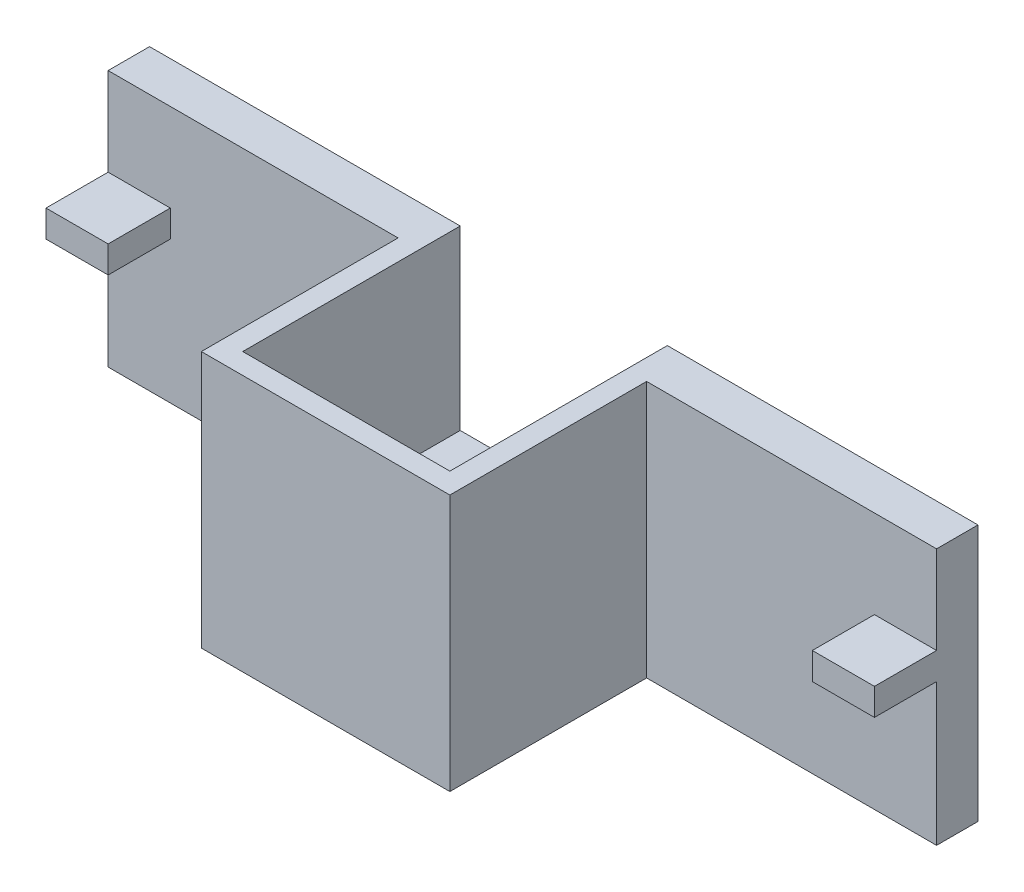
ISO-10303-21;
HEADER;
FILE_DESCRIPTION(('STEP AP214'),'2;1');
FILE_NAME('part.step','',(''),(''),'','','');
FILE_SCHEMA(('AUTOMOTIVE_DESIGN { 1 0 10303 214 1 1 1 1 }'));
ENDSEC;
DATA;
#1=APPLICATION_CONTEXT('core data for automotive mechanical design processes');
#2=APPLICATION_PROTOCOL_DEFINITION('international standard','automotive_design',2000,#1);
#3=PRODUCT_CONTEXT('',#1,'mechanical');
#4=PRODUCT('Part','Part','',(#3));
#5=PRODUCT_RELATED_PRODUCT_CATEGORY('part','',(#4));
#6=PRODUCT_DEFINITION_FORMATION('','',#4);
#7=PRODUCT_DEFINITION_CONTEXT('part definition',#1,'design');
#8=PRODUCT_DEFINITION('design','',#6,#7);
#9=PRODUCT_DEFINITION_SHAPE('','',#8);
#10=(LENGTH_UNIT() NAMED_UNIT(*) SI_UNIT(.MILLI.,.METRE.));
#11=(NAMED_UNIT(*) PLANE_ANGLE_UNIT() SI_UNIT($,.RADIAN.));
#12=(NAMED_UNIT(*) SI_UNIT($,.STERADIAN.) SOLID_ANGLE_UNIT());
#13=UNCERTAINTY_MEASURE_WITH_UNIT(LENGTH_MEASURE(1.E-05),#10,'distance_accuracy_value','');
#14=(GEOMETRIC_REPRESENTATION_CONTEXT(3) GLOBAL_UNCERTAINTY_ASSIGNED_CONTEXT((#13)) GLOBAL_UNIT_ASSIGNED_CONTEXT((#10,
#11,#12)) REPRESENTATION_CONTEXT('',''));
#15=CARTESIAN_POINT('',(0.,0.,0.));
#16=DIRECTION('',(0.,0.,1.));
#17=DIRECTION('',(1.,0.,0.));
#18=AXIS2_PLACEMENT_3D('',#15,#16,#17);
#19=CARTESIAN_POINT('',(29.9999999999999,0.,-9.99999999999998));
#20=DIRECTION('',(-0.999999999999998,0.,0.));
#21=DIRECTION('',(0.,0.,0.999999999999998));
#22=AXIS2_PLACEMENT_3D('',#19,#20,#21);
#23=PLANE('',#22);
#24=DIRECTION('',(0.,0.,-0.999999999999998));
#25=VECTOR('',#24,1.);
#26=CARTESIAN_POINT('',(29.9999999999999,7.7,17.));
#27=LINE('',#26,#25);
#28=CARTESIAN_POINT('',(29.9999999999999,7.7,17.));
#29=VERTEX_POINT('',#28);
#30=CARTESIAN_POINT('',(29.9999999999999,7.7,-4.));
#31=VERTEX_POINT('',#30);
#32=EDGE_CURVE('E182',#29,#31,#27,.T.);
#33=ORIENTED_EDGE('',*,*,#32,.T.);
#34=DIRECTION('',(0.,-1.,0.));
#35=VECTOR('',#34,1.);
#36=CARTESIAN_POINT('',(30.,24.8,-4.));
#37=LINE('',#36,#35);
#38=CARTESIAN_POINT('',(30.,24.8,-4.));
#39=VERTEX_POINT('',#38);
#40=EDGE_CURVE('E68',#39,#31,#37,.T.);
#41=ORIENTED_EDGE('',*,*,#40,.F.);
#42=DIRECTION('',(0.,0.,0.999999999999998));
#43=VECTOR('',#42,1.);
#44=CARTESIAN_POINT('',(30.,24.8,-9.99999999999998));
#45=LINE('',#44,#43);
#46=CARTESIAN_POINT('',(30.,24.8,17.));
#47=VERTEX_POINT('',#46);
#48=EDGE_CURVE('E11',#39,#47,#45,.T.);
#49=ORIENTED_EDGE('',*,*,#48,.T.);
#50=DIRECTION('',(0.,-1.,0.));
#51=VECTOR('',#50,1.);
#52=CARTESIAN_POINT('',(29.9999999999999,55.410455730028,17.));
#53=LINE('',#52,#51);
#54=EDGE_CURVE('E191',#47,#29,#53,.T.);
#55=ORIENTED_EDGE('',*,*,#54,.T.);
#56=EDGE_LOOP('',(#33,#41,#49,#55));
#57=FACE_BOUND('',#56,.T.);
#58=ADVANCED_FACE('F44',(#57),#23,.F.);
#59=CARTESIAN_POINT('',(29.9999999999999,55.410455730028,17.));
#60=DIRECTION('',(0.,0.,-0.999999999999998));
#61=DIRECTION('',(-0.999999999999998,0.,0.));
#62=AXIS2_PLACEMENT_3D('',#59,#60,#61);
#63=PLANE('',#62);
#64=DIRECTION('',(0.,-1.,0.));
#65=VECTOR('',#64,1.);
#66=CARTESIAN_POINT('',(49.9999999999999,55.4104557300279,17.));
#67=LINE('',#66,#65);
#68=CARTESIAN_POINT('',(49.9999999999999,24.8,17.));
#69=VERTEX_POINT('',#68);
#70=CARTESIAN_POINT('',(49.9999999999999,7.7,17.));
#71=VERTEX_POINT('',#70);
#72=EDGE_CURVE('E240',#69,#71,#67,.T.);
#73=ORIENTED_EDGE('',*,*,#72,.T.);
#74=DIRECTION('',(-0.999999999999998,0.,0.));
#75=VECTOR('',#74,1.);
#76=CARTESIAN_POINT('',(29.9999999999999,7.7,17.));
#77=LINE('',#76,#75);
#78=EDGE_CURVE('E450',#71,#29,#77,.T.);
#79=ORIENTED_EDGE('',*,*,#78,.T.);
#80=ORIENTED_EDGE('',*,*,#54,.F.);
#81=DIRECTION('',(-0.999999999999998,0.,0.));
#82=VECTOR('',#81,1.);
#83=CARTESIAN_POINT('',(30.,24.8,17.));
#84=LINE('',#83,#82);
#85=EDGE_CURVE('E328',#69,#47,#84,.T.);
#86=ORIENTED_EDGE('',*,*,#85,.F.);
#87=EDGE_LOOP('',(#73,#79,#80,#86));
#88=FACE_BOUND('',#87,.T.);
#89=ADVANCED_FACE('F457',(#88),#63,.T.);
#90=CARTESIAN_POINT('',(49.9999999999999,55.4104557300279,17.));
#91=DIRECTION('',(-0.999999999999998,0.,0.));
#92=DIRECTION('',(0.,0.,0.999999999999998));
#93=AXIS2_PLACEMENT_3D('',#90,#91,#92);
#94=PLANE('',#93);
#95=DIRECTION('',(0.,1.,0.));
#96=VECTOR('',#95,1.);
#97=CARTESIAN_POINT('',(49.9999999999999,24.8,-4.));
#98=LINE('',#97,#96);
#99=CARTESIAN_POINT('',(49.9999999999999,7.7,-4.));
#100=VERTEX_POINT('',#99);
#101=CARTESIAN_POINT('',(49.9999999999999,24.8,-4.));
#102=VERTEX_POINT('',#101);
#103=EDGE_CURVE('E447',#100,#102,#98,.T.);
#104=ORIENTED_EDGE('',*,*,#103,.F.);
#105=DIRECTION('',(0.,0.,0.999999999999998));
#106=VECTOR('',#105,1.);
#107=CARTESIAN_POINT('',(49.9999999999999,7.7,17.));
#108=LINE('',#107,#106);
#109=EDGE_CURVE('E185',#100,#71,#108,.T.);
#110=ORIENTED_EDGE('',*,*,#109,.T.);
#111=ORIENTED_EDGE('',*,*,#72,.F.);
#112=DIRECTION('',(0.,0.,0.999999999999998));
#113=VECTOR('',#112,1.);
#114=CARTESIAN_POINT('',(49.9999999999999,24.8,17.));
#115=LINE('',#114,#113);
#116=EDGE_CURVE('E325',#102,#69,#115,.T.);
#117=ORIENTED_EDGE('',*,*,#116,.F.);
#118=EDGE_LOOP('',(#104,#110,#111,#117));
#119=FACE_BOUND('',#118,.T.);
#120=ADVANCED_FACE('F456',(#119),#94,.T.);
#121=CARTESIAN_POINT('',(0.,24.8,0.));
#122=DIRECTION('',(0.,0.,-0.999999999999998));
#123=DIRECTION('',(-0.999999999999998,0.,0.));
#124=AXIS2_PLACEMENT_3D('',#121,#122,#123);
#125=PLANE('',#124);
#126=DIRECTION('',(0.,-1.,0.));
#127=VECTOR('',#126,1.);
#128=CARTESIAN_POINT('',(27.9999999999999,55.410455730028,0.));
#129=LINE('',#128,#127);
#130=CARTESIAN_POINT('',(28.,24.8,0.));
#131=VERTEX_POINT('',#130);
#132=CARTESIAN_POINT('',(27.9999999999999,0.,0.));
#133=VERTEX_POINT('',#132);
#134=EDGE_CURVE('E229',#131,#133,#129,.T.);
#135=ORIENTED_EDGE('',*,*,#134,.F.);
#136=DIRECTION('',(0.999999999999998,0.,0.));
#137=VECTOR('',#136,1.);
#138=CARTESIAN_POINT('',(0.,24.8,0.));
#139=LINE('',#138,#137);
#140=CARTESIAN_POINT('',(0.,24.8,0.));
#141=VERTEX_POINT('',#140);
#142=EDGE_CURVE('E205',#141,#131,#139,.T.);
#143=ORIENTED_EDGE('',*,*,#142,.F.);
#144=DIRECTION('',(0.,-1.,0.));
#145=VECTOR('',#144,1.);
#146=CARTESIAN_POINT('',(0.,24.8,0.));
#147=LINE('',#146,#145);
#148=CARTESIAN_POINT('',(0.,16.3,0.));
#149=VERTEX_POINT('',#148);
#150=EDGE_CURVE('E206',#141,#149,#147,.T.);
#151=ORIENTED_EDGE('',*,*,#150,.T.);
#152=DIRECTION('',(-0.999999999999998,0.,0.));
#153=VECTOR('',#152,1.);
#154=CARTESIAN_POINT('',(0.,16.3,0.));
#155=LINE('',#154,#153);
#156=CARTESIAN_POINT('',(5.99999999999998,16.3,0.));
#157=VERTEX_POINT('',#156);
#158=EDGE_CURVE('E274',#157,#149,#155,.T.);
#159=ORIENTED_EDGE('',*,*,#158,.F.);
#160=DIRECTION('',(0.,1.,0.));
#161=VECTOR('',#160,1.);
#162=CARTESIAN_POINT('',(5.99999999999998,16.3,0.));
#163=LINE('',#162,#161);
#164=CARTESIAN_POINT('',(6.,13.7,0.));
#165=VERTEX_POINT('',#164);
#166=EDGE_CURVE('E269',#165,#157,#163,.T.);
#167=ORIENTED_EDGE('',*,*,#166,.F.);
#168=DIRECTION('',(0.999999999999998,0.,0.));
#169=VECTOR('',#168,1.);
#170=CARTESIAN_POINT('',(0.,13.7,0.));
#171=LINE('',#170,#169);
#172=CARTESIAN_POINT('',(0.,13.7,0.));
#173=VERTEX_POINT('',#172);
#174=EDGE_CURVE('E257',#173,#165,#171,.T.);
#175=ORIENTED_EDGE('',*,*,#174,.F.);
#176=CARTESIAN_POINT('',(0.,0.,0.));
#177=VERTEX_POINT('',#176);
#178=EDGE_CURVE('E200',#173,#177,#147,.T.);
#179=ORIENTED_EDGE('',*,*,#178,.T.);
#180=DIRECTION('',(0.999999999999998,0.,0.));
#181=VECTOR('',#180,1.);
#182=CARTESIAN_POINT('',(0.,0.,0.));
#183=LINE('',#182,#181);
#184=EDGE_CURVE('E48',#177,#133,#183,.T.);
#185=ORIENTED_EDGE('',*,*,#184,.T.);
#186=EDGE_LOOP('',(#135,#143,#151,#159,#167,#175,#179,#185));
#187=FACE_BOUND('',#186,.T.);
#188=ADVANCED_FACE('F46',(#187),#125,.F.);
#189=CARTESIAN_POINT('',(0.,24.8,-4.));
#190=DIRECTION('',(0.,0.,0.999999999999998));
#191=DIRECTION('',(0.999999999999998,0.,0.));
#192=AXIS2_PLACEMENT_3D('',#189,#190,#191);
#193=PLANE('',#192);
#194=DIRECTION('',(-0.999999999999998,0.,0.));
#195=VECTOR('',#194,1.);
#196=CARTESIAN_POINT('',(0.,24.8,-4.));
#197=LINE('',#196,#195);
#198=CARTESIAN_POINT('',(0.,24.8,-4.));
#199=VERTEX_POINT('',#198);
#200=EDGE_CURVE('E197',#39,#199,#197,.T.);
#201=ORIENTED_EDGE('',*,*,#200,.F.);
#202=ORIENTED_EDGE('',*,*,#40,.T.);
#203=DIRECTION('',(0.999999999999998,0.,0.));
#204=VECTOR('',#203,1.);
#205=CARTESIAN_POINT('',(29.9999999999999,7.7,-4.));
#206=LINE('',#205,#204);
#207=EDGE_CURVE('E62',#31,#100,#206,.T.);
#208=ORIENTED_EDGE('',*,*,#207,.T.);
#209=ORIENTED_EDGE('',*,*,#103,.T.);
#210=DIRECTION('',(-0.999999999999998,0.,0.));
#211=VECTOR('',#210,1.);
#212=CARTESIAN_POINT('',(0.,24.8,-4.));
#213=LINE('',#212,#211);
#214=CARTESIAN_POINT('',(79.9999999999998,24.8,-4.));
#215=VERTEX_POINT('',#214);
#216=EDGE_CURVE('E395',#215,#102,#213,.T.);
#217=ORIENTED_EDGE('',*,*,#216,.F.);
#218=DIRECTION('',(0.,-1.,0.));
#219=VECTOR('',#218,1.);
#220=CARTESIAN_POINT('',(79.9999999999998,24.8,-4.));
#221=LINE('',#220,#219);
#222=CARTESIAN_POINT('',(79.9999999999998,0.,-4.));
#223=VERTEX_POINT('',#222);
#224=EDGE_CURVE('E397',#215,#223,#221,.T.);
#225=ORIENTED_EDGE('',*,*,#224,.T.);
#226=DIRECTION('',(-0.999999999999998,0.,0.));
#227=VECTOR('',#226,1.);
#228=CARTESIAN_POINT('',(0.,0.,-4.));
#229=LINE('',#228,#227);
#230=CARTESIAN_POINT('',(0.,0.,-4.));
#231=VERTEX_POINT('',#230);
#232=EDGE_CURVE('E199',#223,#231,#229,.T.);
#233=ORIENTED_EDGE('',*,*,#232,.T.);
#234=DIRECTION('',(0.,-1.,0.));
#235=VECTOR('',#234,1.);
#236=CARTESIAN_POINT('',(0.,24.8,-4.));
#237=LINE('',#236,#235);
#238=EDGE_CURVE('E253',#199,#231,#237,.T.);
#239=ORIENTED_EDGE('',*,*,#238,.F.);
#240=EDGE_LOOP('',(#201,#202,#208,#209,#217,#225,#233,#239));
#241=FACE_BOUND('',#240,.T.);
#242=ADVANCED_FACE('F195',(#241),#193,.F.);
#243=CARTESIAN_POINT('',(0.,24.8,0.));
#244=DIRECTION('',(0.,-1.,0.));
#245=DIRECTION('',(0.,0.,-0.999999999999998));
#246=AXIS2_PLACEMENT_3D('',#243,#244,#245);
#247=PLANE('',#246);
#248=ORIENTED_EDGE('',*,*,#142,.T.);
#249=DIRECTION('',(0.,0.,-0.999999999999998));
#250=VECTOR('',#249,1.);
#251=CARTESIAN_POINT('',(28.,24.8,0.));
#252=LINE('',#251,#250);
#253=CARTESIAN_POINT('',(28.,24.8,19.));
#254=VERTEX_POINT('',#253);
#255=EDGE_CURVE('E221',#254,#131,#252,.T.);
#256=ORIENTED_EDGE('',*,*,#255,.F.);
#257=DIRECTION('',(-0.999999999999998,0.,0.));
#258=VECTOR('',#257,1.);
#259=CARTESIAN_POINT('',(30.,24.8,19.));
#260=LINE('',#259,#258);
#261=CARTESIAN_POINT('',(51.9999999999999,24.8,19.));
#262=VERTEX_POINT('',#261);
#263=EDGE_CURVE('E357',#262,#254,#260,.T.);
#264=ORIENTED_EDGE('',*,*,#263,.F.);
#265=DIRECTION('',(0.,0.,0.999999999999998));
#266=VECTOR('',#265,1.);
#267=CARTESIAN_POINT('',(51.9999999999999,24.8,17.));
#268=LINE('',#267,#266);
#269=CARTESIAN_POINT('',(51.9999999999999,24.8,0.));
#270=VERTEX_POINT('',#269);
#271=EDGE_CURVE('E351',#270,#262,#268,.T.);
#272=ORIENTED_EDGE('',*,*,#271,.F.);
#273=DIRECTION('',(0.999999999999998,0.,0.));
#274=VECTOR('',#273,1.);
#275=CARTESIAN_POINT('',(0.,24.8,0.));
#276=LINE('',#275,#274);
#277=CARTESIAN_POINT('',(79.9999999999998,24.8,0.));
#278=VERTEX_POINT('',#277);
#279=EDGE_CURVE('E374',#270,#278,#276,.T.);
#280=ORIENTED_EDGE('',*,*,#279,.T.);
#281=DIRECTION('',(0.,0.,-0.999999999999998));
#282=VECTOR('',#281,1.);
#283=CARTESIAN_POINT('',(79.9999999999998,24.8,0.));
#284=LINE('',#283,#282);
#285=EDGE_CURVE('E406',#278,#215,#284,.T.);
#286=ORIENTED_EDGE('',*,*,#285,.T.);
#287=ORIENTED_EDGE('',*,*,#216,.T.);
#288=ORIENTED_EDGE('',*,*,#116,.T.);
#289=ORIENTED_EDGE('',*,*,#85,.T.);
#290=ORIENTED_EDGE('',*,*,#48,.F.);
#291=ORIENTED_EDGE('',*,*,#200,.T.);
#292=DIRECTION('',(0.,0.,0.999999999999998));
#293=VECTOR('',#292,1.);
#294=CARTESIAN_POINT('',(0.,24.8,0.));
#295=LINE('',#294,#293);
#296=EDGE_CURVE('E214',#199,#141,#295,.T.);
#297=ORIENTED_EDGE('',*,*,#296,.T.);
#298=EDGE_LOOP('',(#248,#256,#264,#272,#280,#286,#287,#288,#289,#290,#291,#297));
#299=FACE_BOUND('',#298,.T.);
#300=ADVANCED_FACE('F220',(#299),#247,.F.);
#301=CARTESIAN_POINT('',(0.,0.,0.));
#302=DIRECTION('',(0.,-1.,0.));
#303=DIRECTION('',(0.,0.,-0.999999999999998));
#304=AXIS2_PLACEMENT_3D('',#301,#302,#303);
#305=PLANE('',#304);
#306=ORIENTED_EDGE('',*,*,#232,.F.);
#307=DIRECTION('',(0.,0.,-0.999999999999998));
#308=VECTOR('',#307,1.);
#309=CARTESIAN_POINT('',(79.9999999999998,0.,0.));
#310=LINE('',#309,#308);
#311=CARTESIAN_POINT('',(79.9999999999998,0.,0.));
#312=VERTEX_POINT('',#311);
#313=EDGE_CURVE('E384',#312,#223,#310,.T.);
#314=ORIENTED_EDGE('',*,*,#313,.F.);
#315=DIRECTION('',(0.999999999999998,0.,0.));
#316=VECTOR('',#315,1.);
#317=CARTESIAN_POINT('',(0.,0.,0.));
#318=LINE('',#317,#316);
#319=CARTESIAN_POINT('',(51.9999999999999,0.,0.));
#320=VERTEX_POINT('',#319);
#321=EDGE_CURVE('E382',#320,#312,#318,.T.);
#322=ORIENTED_EDGE('',*,*,#321,.F.);
#323=DIRECTION('',(0.,0.,0.999999999999998));
#324=VECTOR('',#323,1.);
#325=CARTESIAN_POINT('',(51.9999999999999,0.,17.));
#326=LINE('',#325,#324);
#327=CARTESIAN_POINT('',(51.9999999999999,0.,19.));
#328=VERTEX_POINT('',#327);
#329=EDGE_CURVE('E339',#328,#320,#326,.F.);
#330=ORIENTED_EDGE('',*,*,#329,.F.);
#331=DIRECTION('',(0.999999999999998,0.,0.));
#332=VECTOR('',#331,1.);
#333=CARTESIAN_POINT('',(29.9999999999999,0.,19.));
#334=LINE('',#333,#332);
#335=CARTESIAN_POINT('',(27.9999999999999,0.,19.));
#336=VERTEX_POINT('',#335);
#337=EDGE_CURVE('E343',#336,#328,#334,.T.);
#338=ORIENTED_EDGE('',*,*,#337,.F.);
#339=DIRECTION('',(0.,0.,0.999999999999998));
#340=VECTOR('',#339,1.);
#341=CARTESIAN_POINT('',(27.9999999999999,0.,0.));
#342=LINE('',#341,#340);
#343=EDGE_CURVE('E250',#133,#336,#342,.T.);
#344=ORIENTED_EDGE('',*,*,#343,.F.);
#345=ORIENTED_EDGE('',*,*,#184,.F.);
#346=DIRECTION('',(0.,0.,0.999999999999998));
#347=VECTOR('',#346,1.);
#348=CARTESIAN_POINT('',(0.,0.,0.));
#349=LINE('',#348,#347);
#350=EDGE_CURVE('E259',#231,#177,#349,.T.);
#351=ORIENTED_EDGE('',*,*,#350,.F.);
#352=EDGE_LOOP('',(#306,#314,#322,#330,#338,#344,#345,#351));
#353=FACE_BOUND('',#352,.T.);
#354=ADVANCED_FACE('F320',(#353),#305,.T.);
#355=CARTESIAN_POINT('',(0.,24.8,0.));
#356=DIRECTION('',(0.999999999999998,0.,0.));
#357=DIRECTION('',(0.,0.,-0.999999999999998));
#358=AXIS2_PLACEMENT_3D('',#355,#356,#357);
#359=PLANE('',#358);
#360=ORIENTED_EDGE('',*,*,#350,.T.);
#361=ORIENTED_EDGE('',*,*,#178,.F.);
#362=DIRECTION('',(0.,0.,-0.999999999999998));
#363=VECTOR('',#362,1.);
#364=CARTESIAN_POINT('',(0.,13.7,5.99999999999999));
#365=LINE('',#364,#363);
#366=CARTESIAN_POINT('',(0.,13.7,5.99999999999999));
#367=VERTEX_POINT('',#366);
#368=EDGE_CURVE('E265',#367,#173,#365,.T.);
#369=ORIENTED_EDGE('',*,*,#368,.F.);
#370=DIRECTION('',(0.,-1.,0.));
#371=VECTOR('',#370,1.);
#372=CARTESIAN_POINT('',(0.,16.3,5.99999999999999));
#373=LINE('',#372,#371);
#374=CARTESIAN_POINT('',(0.,16.3,5.99999999999999));
#375=VERTEX_POINT('',#374);
#376=EDGE_CURVE('E209',#375,#367,#373,.T.);
#377=ORIENTED_EDGE('',*,*,#376,.F.);
#378=DIRECTION('',(0.,0.,-0.999999999999998));
#379=VECTOR('',#378,1.);
#380=CARTESIAN_POINT('',(0.,16.3,5.99999999999999));
#381=LINE('',#380,#379);
#382=EDGE_CURVE('E258',#375,#149,#381,.T.);
#383=ORIENTED_EDGE('',*,*,#382,.T.);
#384=ORIENTED_EDGE('',*,*,#150,.F.);
#385=ORIENTED_EDGE('',*,*,#296,.F.);
#386=ORIENTED_EDGE('',*,*,#238,.T.);
#387=EDGE_LOOP('',(#360,#361,#369,#377,#383,#384,#385,#386));
#388=FACE_BOUND('',#387,.T.);
#389=ADVANCED_FACE('F309',(#388),#359,.F.);
#390=CARTESIAN_POINT('',(0.,13.7,5.99999999999999));
#391=DIRECTION('',(0.,1.,0.));
#392=DIRECTION('',(0.,0.,0.999999999999998));
#393=AXIS2_PLACEMENT_3D('',#390,#391,#392);
#394=PLANE('',#393);
#395=ORIENTED_EDGE('',*,*,#174,.T.);
#396=DIRECTION('',(0.,0.,-0.999999999999998));
#397=VECTOR('',#396,1.);
#398=CARTESIAN_POINT('',(6.,13.7,5.99999999999999));
#399=LINE('',#398,#397);
#400=CARTESIAN_POINT('',(6.,13.7,5.99999999999999));
#401=VERTEX_POINT('',#400);
#402=EDGE_CURVE('E270',#401,#165,#399,.T.);
#403=ORIENTED_EDGE('',*,*,#402,.F.);
#404=DIRECTION('',(0.999999999999998,0.,0.));
#405=VECTOR('',#404,1.);
#406=CARTESIAN_POINT('',(0.,13.7,5.99999999999999));
#407=LINE('',#406,#405);
#408=EDGE_CURVE('E294',#367,#401,#407,.T.);
#409=ORIENTED_EDGE('',*,*,#408,.F.);
#410=ORIENTED_EDGE('',*,*,#368,.T.);
#411=EDGE_LOOP('',(#395,#403,#409,#410));
#412=FACE_BOUND('',#411,.T.);
#413=ADVANCED_FACE('F311',(#412),#394,.F.);
#414=CARTESIAN_POINT('',(5.99999999999998,16.3,5.99999999999999));
#415=DIRECTION('',(-0.999999999999998,0.,0.));
#416=DIRECTION('',(0.,-1.,0.));
#417=AXIS2_PLACEMENT_3D('',#414,#415,#416);
#418=PLANE('',#417);
#419=ORIENTED_EDGE('',*,*,#166,.T.);
#420=DIRECTION('',(0.,0.,-0.999999999999998));
#421=VECTOR('',#420,1.);
#422=CARTESIAN_POINT('',(5.99999999999998,16.3,5.99999999999999));
#423=LINE('',#422,#421);
#424=CARTESIAN_POINT('',(5.99999999999998,16.3,5.99999999999999));
#425=VERTEX_POINT('',#424);
#426=EDGE_CURVE('E275',#425,#157,#423,.T.);
#427=ORIENTED_EDGE('',*,*,#426,.F.);
#428=DIRECTION('',(0.,1.,0.));
#429=VECTOR('',#428,1.);
#430=CARTESIAN_POINT('',(5.99999999999998,16.3,5.99999999999999));
#431=LINE('',#430,#429);
#432=EDGE_CURVE('E292',#401,#425,#431,.T.);
#433=ORIENTED_EDGE('',*,*,#432,.F.);
#434=ORIENTED_EDGE('',*,*,#402,.T.);
#435=EDGE_LOOP('',(#419,#427,#433,#434));
#436=FACE_BOUND('',#435,.T.);
#437=ADVANCED_FACE('F315',(#436),#418,.F.);
#438=CARTESIAN_POINT('',(0.,16.3,5.99999999999999));
#439=DIRECTION('',(0.,-1.,0.));
#440=DIRECTION('',(0.,0.,-0.999999999999998));
#441=AXIS2_PLACEMENT_3D('',#438,#439,#440);
#442=PLANE('',#441);
#443=ORIENTED_EDGE('',*,*,#158,.T.);
#444=ORIENTED_EDGE('',*,*,#382,.F.);
#445=DIRECTION('',(-0.999999999999998,0.,0.));
#446=VECTOR('',#445,1.);
#447=CARTESIAN_POINT('',(0.,16.3,5.99999999999999));
#448=LINE('',#447,#446);
#449=EDGE_CURVE('E54',#425,#375,#448,.T.);
#450=ORIENTED_EDGE('',*,*,#449,.F.);
#451=ORIENTED_EDGE('',*,*,#426,.T.);
#452=EDGE_LOOP('',(#443,#444,#450,#451));
#453=FACE_BOUND('',#452,.T.);
#454=ADVANCED_FACE('F317',(#453),#442,.F.);
#455=CARTESIAN_POINT('',(0.,0.,5.99999999999999));
#456=DIRECTION('',(0.,0.,0.999999999999998));
#457=DIRECTION('',(0.999999999999998,0.,0.));
#458=AXIS2_PLACEMENT_3D('',#455,#456,#457);
#459=PLANE('',#458);
#460=ORIENTED_EDGE('',*,*,#376,.T.);
#461=ORIENTED_EDGE('',*,*,#408,.T.);
#462=ORIENTED_EDGE('',*,*,#432,.T.);
#463=ORIENTED_EDGE('',*,*,#449,.T.);
#464=EDGE_LOOP('',(#460,#461,#462,#463));
#465=FACE_BOUND('',#464,.T.);
#466=ADVANCED_FACE('F304',(#465),#459,.T.);
#467=CARTESIAN_POINT('',(51.9999999999999,55.4104557300279,17.));
#468=DIRECTION('',(-0.999999999999998,0.,0.));
#469=DIRECTION('',(0.,0.,0.999999999999998));
#470=AXIS2_PLACEMENT_3D('',#467,#468,#469);
#471=PLANE('',#470);
#472=DIRECTION('',(0.,-1.,0.));
#473=VECTOR('',#472,1.);
#474=CARTESIAN_POINT('',(51.9999999999999,55.4104557300279,0.));
#475=LINE('',#474,#473);
#476=EDGE_CURVE('E248',#270,#320,#475,.T.);
#477=ORIENTED_EDGE('',*,*,#476,.F.);
#478=ORIENTED_EDGE('',*,*,#271,.T.);
#479=DIRECTION('',(0.,-1.,0.));
#480=VECTOR('',#479,1.);
#481=CARTESIAN_POINT('',(51.9999999999999,55.4104557300279,19.));
#482=LINE('',#481,#480);
#483=EDGE_CURVE('E242',#262,#328,#482,.T.);
#484=ORIENTED_EDGE('',*,*,#483,.T.);
#485=ORIENTED_EDGE('',*,*,#329,.T.);
#486=EDGE_LOOP('',(#477,#478,#484,#485));
#487=FACE_BOUND('',#486,.T.);
#488=ADVANCED_FACE('F376',(#487),#471,.F.);
#489=CARTESIAN_POINT('',(29.9999999999999,55.410455730028,19.));
#490=DIRECTION('',(0.,0.,-0.999999999999998));
#491=DIRECTION('',(-0.999999999999998,0.,0.));
#492=AXIS2_PLACEMENT_3D('',#489,#490,#491);
#493=PLANE('',#492);
#494=ORIENTED_EDGE('',*,*,#483,.F.);
#495=ORIENTED_EDGE('',*,*,#263,.T.);
#496=DIRECTION('',(0.,-1.,0.));
#497=VECTOR('',#496,1.);
#498=CARTESIAN_POINT('',(27.9999999999999,55.410455730028,19.));
#499=LINE('',#498,#497);
#500=EDGE_CURVE('E235',#254,#336,#499,.T.);
#501=ORIENTED_EDGE('',*,*,#500,.T.);
#502=ORIENTED_EDGE('',*,*,#337,.T.);
#503=EDGE_LOOP('',(#494,#495,#501,#502));
#504=FACE_BOUND('',#503,.T.);
#505=ADVANCED_FACE('F373',(#504),#493,.F.);
#506=CARTESIAN_POINT('',(27.9999999999999,55.410455730028,0.));
#507=DIRECTION('',(0.999999999999998,0.,0.));
#508=DIRECTION('',(0.,0.,-0.999999999999998));
#509=AXIS2_PLACEMENT_3D('',#506,#507,#508);
#510=PLANE('',#509);
#511=ORIENTED_EDGE('',*,*,#500,.F.);
#512=ORIENTED_EDGE('',*,*,#255,.T.);
#513=ORIENTED_EDGE('',*,*,#134,.T.);
#514=ORIENTED_EDGE('',*,*,#343,.T.);
#515=EDGE_LOOP('',(#511,#512,#513,#514));
#516=FACE_BOUND('',#515,.T.);
#517=ADVANCED_FACE('F370',(#516),#510,.F.);
#518=CARTESIAN_POINT('',(0.,24.8,0.));
#519=DIRECTION('',(0.,0.,-0.999999999999998));
#520=DIRECTION('',(-0.999999999999998,0.,0.));
#521=AXIS2_PLACEMENT_3D('',#518,#519,#520);
#522=PLANE('',#521);
#523=ORIENTED_EDGE('',*,*,#279,.F.);
#524=ORIENTED_EDGE('',*,*,#476,.T.);
#525=ORIENTED_EDGE('',*,*,#321,.T.);
#526=DIRECTION('',(0.,-1.,0.));
#527=VECTOR('',#526,1.);
#528=CARTESIAN_POINT('',(79.9999999999998,24.8,0.));
#529=LINE('',#528,#527);
#530=CARTESIAN_POINT('',(79.9999999999998,13.7,0.));
#531=VERTEX_POINT('',#530);
#532=EDGE_CURVE('E400',#531,#312,#529,.T.);
#533=ORIENTED_EDGE('',*,*,#532,.F.);
#534=DIRECTION('',(0.999999999999998,0.,0.));
#535=VECTOR('',#534,1.);
#536=CARTESIAN_POINT('',(79.9999999999998,13.7,0.));
#537=LINE('',#536,#535);
#538=CARTESIAN_POINT('',(73.9999999999998,13.7,0.));
#539=VERTEX_POINT('',#538);
#540=EDGE_CURVE('E418',#539,#531,#537,.T.);
#541=ORIENTED_EDGE('',*,*,#540,.F.);
#542=DIRECTION('',(0.,-1.,0.));
#543=VECTOR('',#542,1.);
#544=CARTESIAN_POINT('',(73.9999999999998,16.3,0.));
#545=LINE('',#544,#543);
#546=CARTESIAN_POINT('',(73.9999999999998,16.3,0.));
#547=VERTEX_POINT('',#546);
#548=EDGE_CURVE('E392',#547,#539,#545,.T.);
#549=ORIENTED_EDGE('',*,*,#548,.F.);
#550=DIRECTION('',(-0.999999999999998,0.,0.));
#551=VECTOR('',#550,1.);
#552=CARTESIAN_POINT('',(79.9999999999998,16.3,0.));
#553=LINE('',#552,#551);
#554=CARTESIAN_POINT('',(79.9999999999998,16.3,0.));
#555=VERTEX_POINT('',#554);
#556=EDGE_CURVE('E386',#555,#547,#553,.T.);
#557=ORIENTED_EDGE('',*,*,#556,.F.);
#558=EDGE_CURVE('E344',#278,#555,#529,.T.);
#559=ORIENTED_EDGE('',*,*,#558,.F.);
#560=EDGE_LOOP('',(#523,#524,#525,#533,#541,#549,#557,#559));
#561=FACE_BOUND('',#560,.T.);
#562=ADVANCED_FACE('F380',(#561),#522,.F.);
#563=CARTESIAN_POINT('',(0.,0.,5.99999999999999));
#564=DIRECTION('',(0.,0.,-0.999999999999998));
#565=DIRECTION('',(-0.999999999999998,0.,0.));
#566=AXIS2_PLACEMENT_3D('',#563,#564,#565);
#567=PLANE('',#566);
#568=DIRECTION('',(0.,1.,0.));
#569=VECTOR('',#568,1.);
#570=CARTESIAN_POINT('',(79.9999999999998,16.3,5.99999999999999));
#571=LINE('',#570,#569);
#572=CARTESIAN_POINT('',(79.9999999999998,13.7,5.99999999999999));
#573=VERTEX_POINT('',#572);
#574=CARTESIAN_POINT('',(79.9999999999998,16.3,5.99999999999999));
#575=VERTEX_POINT('',#574);
#576=EDGE_CURVE('E414',#573,#575,#571,.T.);
#577=ORIENTED_EDGE('',*,*,#576,.T.);
#578=DIRECTION('',(-0.999999999999998,0.,0.));
#579=VECTOR('',#578,1.);
#580=CARTESIAN_POINT('',(79.9999999999998,16.3,5.99999999999999));
#581=LINE('',#580,#579);
#582=CARTESIAN_POINT('',(73.9999999999998,16.3,5.99999999999999));
#583=VERTEX_POINT('',#582);
#584=EDGE_CURVE('E419',#575,#583,#581,.T.);
#585=ORIENTED_EDGE('',*,*,#584,.T.);
#586=DIRECTION('',(0.,-1.,0.));
#587=VECTOR('',#586,1.);
#588=CARTESIAN_POINT('',(73.9999999999998,16.3,5.99999999999999));
#589=LINE('',#588,#587);
#590=CARTESIAN_POINT('',(73.9999999999998,13.7,5.99999999999999));
#591=VERTEX_POINT('',#590);
#592=EDGE_CURVE('E422',#583,#591,#589,.T.);
#593=ORIENTED_EDGE('',*,*,#592,.T.);
#594=DIRECTION('',(0.999999999999998,0.,0.));
#595=VECTOR('',#594,1.);
#596=CARTESIAN_POINT('',(79.9999999999998,13.7,5.99999999999999));
#597=LINE('',#596,#595);
#598=EDGE_CURVE('E425',#591,#573,#597,.T.);
#599=ORIENTED_EDGE('',*,*,#598,.T.);
#600=EDGE_LOOP('',(#577,#585,#593,#599));
#601=FACE_BOUND('',#600,.T.);
#602=ADVANCED_FACE('F590',(#601),#567,.F.);
#603=CARTESIAN_POINT('',(79.9999999999998,16.3,5.99999999999999));
#604=DIRECTION('',(0.,-1.,0.));
#605=DIRECTION('',(0.999999999999998,0.,0.));
#606=AXIS2_PLACEMENT_3D('',#603,#604,#605);
#607=PLANE('',#606);
#608=ORIENTED_EDGE('',*,*,#556,.T.);
#609=DIRECTION('',(0.,0.,-0.999999999999998));
#610=VECTOR('',#609,1.);
#611=CARTESIAN_POINT('',(73.9999999999998,16.3,5.99999999999999));
#612=LINE('',#611,#610);
#613=EDGE_CURVE('E440',#583,#547,#612,.T.);
#614=ORIENTED_EDGE('',*,*,#613,.F.);
#615=ORIENTED_EDGE('',*,*,#584,.F.);
#616=DIRECTION('',(0.,0.,-0.999999999999998));
#617=VECTOR('',#616,1.);
#618=CARTESIAN_POINT('',(79.9999999999998,16.3,5.99999999999999));
#619=LINE('',#618,#617);
#620=EDGE_CURVE('E444',#575,#555,#619,.T.);
#621=ORIENTED_EDGE('',*,*,#620,.T.);
#622=EDGE_LOOP('',(#608,#614,#615,#621));
#623=FACE_BOUND('',#622,.T.);
#624=ADVANCED_FACE('F597',(#623),#607,.F.);
#625=CARTESIAN_POINT('',(73.9999999999998,16.3,5.99999999999999));
#626=DIRECTION('',(0.999999999999998,0.,0.));
#627=DIRECTION('',(0.,0.,-0.999999999999998));
#628=AXIS2_PLACEMENT_3D('',#625,#626,#627);
#629=PLANE('',#628);
#630=ORIENTED_EDGE('',*,*,#548,.T.);
#631=DIRECTION('',(0.,0.,-0.999999999999998));
#632=VECTOR('',#631,1.);
#633=CARTESIAN_POINT('',(73.9999999999998,13.7,5.99999999999999));
#634=LINE('',#633,#632);
#635=EDGE_CURVE('E436',#591,#539,#634,.T.);
#636=ORIENTED_EDGE('',*,*,#635,.F.);
#637=ORIENTED_EDGE('',*,*,#592,.F.);
#638=ORIENTED_EDGE('',*,*,#613,.T.);
#639=EDGE_LOOP('',(#630,#636,#637,#638));
#640=FACE_BOUND('',#639,.T.);
#641=ADVANCED_FACE('F607',(#640),#629,.F.);
#642=CARTESIAN_POINT('',(79.9999999999998,13.7,5.99999999999999));
#643=DIRECTION('',(0.,1.,0.));
#644=DIRECTION('',(-0.999999999999998,0.,0.));
#645=AXIS2_PLACEMENT_3D('',#642,#643,#644);
#646=PLANE('',#645);
#647=ORIENTED_EDGE('',*,*,#540,.T.);
#648=DIRECTION('',(0.,0.,-0.999999999999998));
#649=VECTOR('',#648,1.);
#650=CARTESIAN_POINT('',(79.9999999999998,13.7,5.99999999999999));
#651=LINE('',#650,#649);
#652=EDGE_CURVE('E427',#573,#531,#651,.T.);
#653=ORIENTED_EDGE('',*,*,#652,.F.);
#654=ORIENTED_EDGE('',*,*,#598,.F.);
#655=ORIENTED_EDGE('',*,*,#635,.T.);
#656=EDGE_LOOP('',(#647,#653,#654,#655));
#657=FACE_BOUND('',#656,.T.);
#658=ADVANCED_FACE('F617',(#657),#646,.F.);
#659=CARTESIAN_POINT('',(79.9999999999998,24.8,0.));
#660=DIRECTION('',(-0.999999999999998,0.,0.));
#661=DIRECTION('',(0.,0.,0.999999999999998));
#662=AXIS2_PLACEMENT_3D('',#659,#660,#661);
#663=PLANE('',#662);
#664=ORIENTED_EDGE('',*,*,#313,.T.);
#665=ORIENTED_EDGE('',*,*,#224,.F.);
#666=ORIENTED_EDGE('',*,*,#285,.F.);
#667=ORIENTED_EDGE('',*,*,#558,.T.);
#668=ORIENTED_EDGE('',*,*,#620,.F.);
#669=ORIENTED_EDGE('',*,*,#576,.F.);
#670=ORIENTED_EDGE('',*,*,#652,.T.);
#671=ORIENTED_EDGE('',*,*,#532,.T.);
#672=EDGE_LOOP('',(#664,#665,#666,#667,#668,#669,#670,#671));
#673=FACE_BOUND('',#672,.T.);
#674=ADVANCED_FACE('F525',(#673),#663,.F.);
#675=CARTESIAN_POINT('',(0.,7.7,0.));
#676=DIRECTION('',(0.,-1.,0.));
#677=DIRECTION('',(0.,0.,-0.999999999999998));
#678=AXIS2_PLACEMENT_3D('',#675,#676,#677);
#679=PLANE('',#678);
#680=ORIENTED_EDGE('',*,*,#32,.F.);
#681=ORIENTED_EDGE('',*,*,#78,.F.);
#682=ORIENTED_EDGE('',*,*,#109,.F.);
#683=ORIENTED_EDGE('',*,*,#207,.F.);
#684=EDGE_LOOP('',(#680,#681,#682,#683));
#685=FACE_BOUND('',#684,.T.);
#686=ADVANCED_FACE('F181',(#685),#679,.F.);
#687=CLOSED_SHELL('',(#58,#89,#120,#188,#242,#300,#354,#389,#413,#437,#454,#466,#488,#505,#517,
#562,#602,#624,#641,#658,#674,#686));
#688=MANIFOLD_SOLID_BREP('B2',#687);
#689=ADVANCED_BREP_SHAPE_REPRESENTATION('',(#18,#688),#14);
#690=SHAPE_DEFINITION_REPRESENTATION(#9,#689);
ENDSEC;
END-ISO-10303-21;
